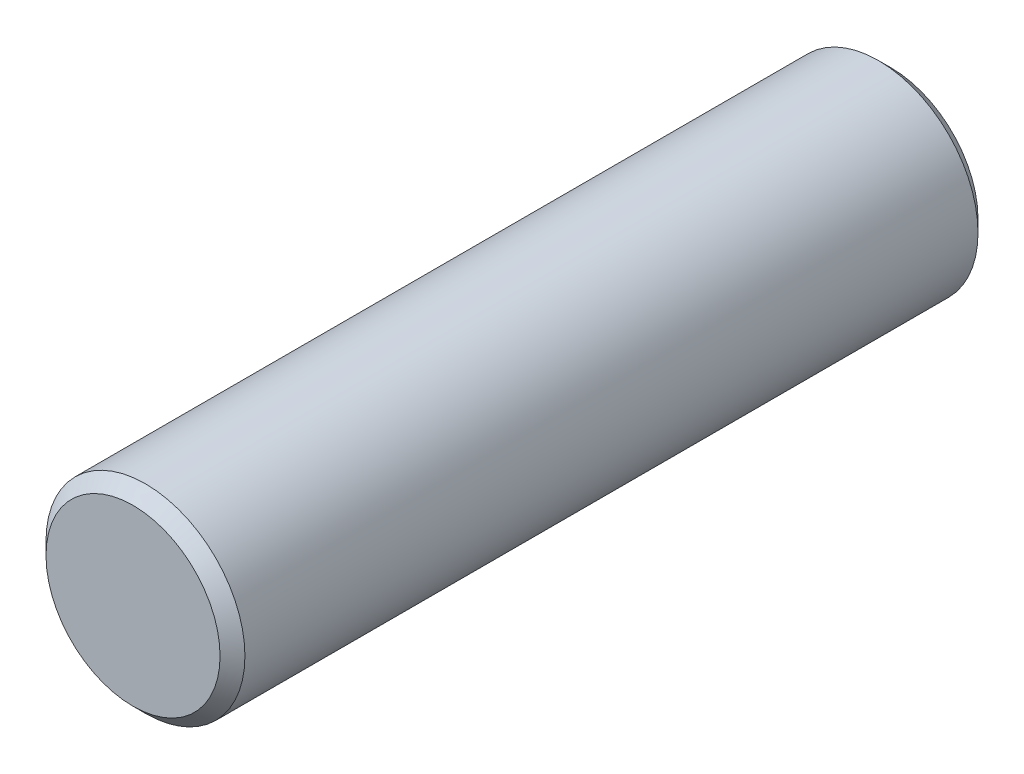
ISO-10303-21;
HEADER;
FILE_DESCRIPTION(('STEP AP214'),'2;1');
FILE_NAME('part.step','',(''),(''),'','','');
FILE_SCHEMA(('AUTOMOTIVE_DESIGN { 1 0 10303 214 1 1 1 1 }'));
ENDSEC;
DATA;
#1=APPLICATION_CONTEXT('core data for automotive mechanical design processes');
#2=APPLICATION_PROTOCOL_DEFINITION('international standard','automotive_design',2000,#1);
#3=PRODUCT_CONTEXT('',#1,'mechanical');
#4=PRODUCT('Part','Part','',(#3));
#5=PRODUCT_RELATED_PRODUCT_CATEGORY('part','',(#4));
#6=PRODUCT_DEFINITION_FORMATION('','',#4);
#7=PRODUCT_DEFINITION_CONTEXT('part definition',#1,'design');
#8=PRODUCT_DEFINITION('design','',#6,#7);
#9=PRODUCT_DEFINITION_SHAPE('','',#8);
#10=(LENGTH_UNIT() NAMED_UNIT(*) SI_UNIT(.MILLI.,.METRE.));
#11=(NAMED_UNIT(*) PLANE_ANGLE_UNIT() SI_UNIT($,.RADIAN.));
#12=(NAMED_UNIT(*) SI_UNIT($,.STERADIAN.) SOLID_ANGLE_UNIT());
#13=UNCERTAINTY_MEASURE_WITH_UNIT(LENGTH_MEASURE(1.E-05),#10,'distance_accuracy_value','');
#14=(GEOMETRIC_REPRESENTATION_CONTEXT(3) GLOBAL_UNCERTAINTY_ASSIGNED_CONTEXT((#13)) GLOBAL_UNIT_ASSIGNED_CONTEXT((#10,
#11,#12)) REPRESENTATION_CONTEXT('',''));
#15=CARTESIAN_POINT('',(0.,0.,0.));
#16=DIRECTION('',(0.,0.,1.));
#17=DIRECTION('',(1.,0.,0.));
#18=AXIS2_PLACEMENT_3D('',#15,#16,#17);
#19=CARTESIAN_POINT('',(0.,0.,30.48));
#20=DIRECTION('',(0.,0.,-1.));
#21=DIRECTION('',(-1.,0.,0.));
#22=AXIS2_PLACEMENT_3D('',#19,#20,#21);
#23=CYLINDRICAL_SURFACE('',#22,4.);
#24=CARTESIAN_POINT('',(0.,0.,0.500000000000028));
#25=DIRECTION('',(0.,0.,1.));
#26=DIRECTION('',(1.,0.,0.));
#27=AXIS2_PLACEMENT_3D('',#24,#25,#26);
#28=CIRCLE('',#27,4.);
#29=CARTESIAN_POINT('',(4.,0.,0.500000000000028));
#30=VERTEX_POINT('',#29);
#31=EDGE_CURVE('E53',#30,#30,#28,.T.);
#32=ORIENTED_EDGE('',*,*,#31,.T.);
#33=EDGE_LOOP('',(#32));
#34=FACE_BOUND('',#33,.T.);
#35=CARTESIAN_POINT('',(0.,0.,29.98));
#36=DIRECTION('',(0.,0.,1.));
#37=DIRECTION('',(1.,0.,0.));
#38=AXIS2_PLACEMENT_3D('',#35,#36,#37);
#39=CIRCLE('',#38,4.);
#40=CARTESIAN_POINT('',(4.,0.,29.98));
#41=VERTEX_POINT('',#40);
#42=EDGE_CURVE('E58',#41,#41,#39,.F.);
#43=ORIENTED_EDGE('',*,*,#42,.T.);
#44=EDGE_LOOP('',(#43));
#45=FACE_BOUND('',#44,.T.);
#46=ADVANCED_FACE('F39',(#34,#45),#23,.T.);
#47=CARTESIAN_POINT('',(0.,0.,30.48));
#48=DIRECTION('',(0.,0.,1.));
#49=DIRECTION('',(1.,0.,0.));
#50=AXIS2_PLACEMENT_3D('',#47,#48,#49);
#51=PLANE('',#50);
#52=CARTESIAN_POINT('',(0.,0.,30.48));
#53=DIRECTION('',(0.,0.,1.));
#54=DIRECTION('',(1.,0.,0.));
#55=AXIS2_PLACEMENT_3D('',#52,#53,#54);
#56=CIRCLE('',#55,3.50000000000001);
#57=CARTESIAN_POINT('',(3.50000000000001,0.,30.48));
#58=VERTEX_POINT('',#57);
#59=EDGE_CURVE('E10',#58,#58,#56,.T.);
#60=ORIENTED_EDGE('',*,*,#59,.T.);
#61=EDGE_LOOP('',(#60));
#62=FACE_BOUND('',#61,.T.);
#63=ADVANCED_FACE('F75',(#62),#51,.T.);
#64=CARTESIAN_POINT('',(0.,0.,0.));
#65=DIRECTION('',(0.,0.,1.));
#66=DIRECTION('',(1.,0.,0.));
#67=AXIS2_PLACEMENT_3D('',#64,#65,#66);
#68=PLANE('',#67);
#69=CARTESIAN_POINT('',(0.,0.,0.));
#70=DIRECTION('',(0.,0.,1.));
#71=DIRECTION('',(1.,0.,0.));
#72=AXIS2_PLACEMENT_3D('',#69,#70,#71);
#73=CIRCLE('',#72,3.49999999999997);
#74=CARTESIAN_POINT('',(3.49999999999997,0.,0.));
#75=VERTEX_POINT('',#74);
#76=EDGE_CURVE('E48',#75,#75,#73,.F.);
#77=ORIENTED_EDGE('',*,*,#76,.T.);
#78=EDGE_LOOP('',(#77));
#79=FACE_BOUND('',#78,.T.);
#80=ADVANCED_FACE('F72',(#79),#68,.F.);
#81=CARTESIAN_POINT('',(0.,0.,0.500000000000028));
#82=DIRECTION('',(0.,0.,1.));
#83=DIRECTION('',(1.,0.,0.));
#84=AXIS2_PLACEMENT_3D('',#81,#82,#83);
#85=CONICAL_SURFACE('',#84,4.,0.785398163397449);
#86=ORIENTED_EDGE('',*,*,#76,.F.);
#87=EDGE_LOOP('',(#86));
#88=FACE_BOUND('',#87,.T.);
#89=ORIENTED_EDGE('',*,*,#31,.F.);
#90=EDGE_LOOP('',(#89));
#91=FACE_BOUND('',#90,.T.);
#92=ADVANCED_FACE('F68',(#88,#91),#85,.T.);
#93=CARTESIAN_POINT('',(0.,0.,30.48));
#94=DIRECTION('',(0.,0.,-1.));
#95=DIRECTION('',(-1.,0.,0.));
#96=AXIS2_PLACEMENT_3D('',#93,#94,#95);
#97=CONICAL_SURFACE('',#96,3.50000000000001,0.785398163397442);
#98=ORIENTED_EDGE('',*,*,#42,.F.);
#99=EDGE_LOOP('',(#98));
#100=FACE_BOUND('',#99,.T.);
#101=ORIENTED_EDGE('',*,*,#59,.F.);
#102=EDGE_LOOP('',(#101));
#103=FACE_BOUND('',#102,.T.);
#104=ADVANCED_FACE('F42',(#100,#103),#97,.T.);
#105=CLOSED_SHELL('',(#46,#63,#80,#92,#104));
#106=MANIFOLD_SOLID_BREP('B2',#105);
#107=ADVANCED_BREP_SHAPE_REPRESENTATION('',(#18,#106),#14);
#108=SHAPE_DEFINITION_REPRESENTATION(#9,#107);
ENDSEC;
END-ISO-10303-21;
